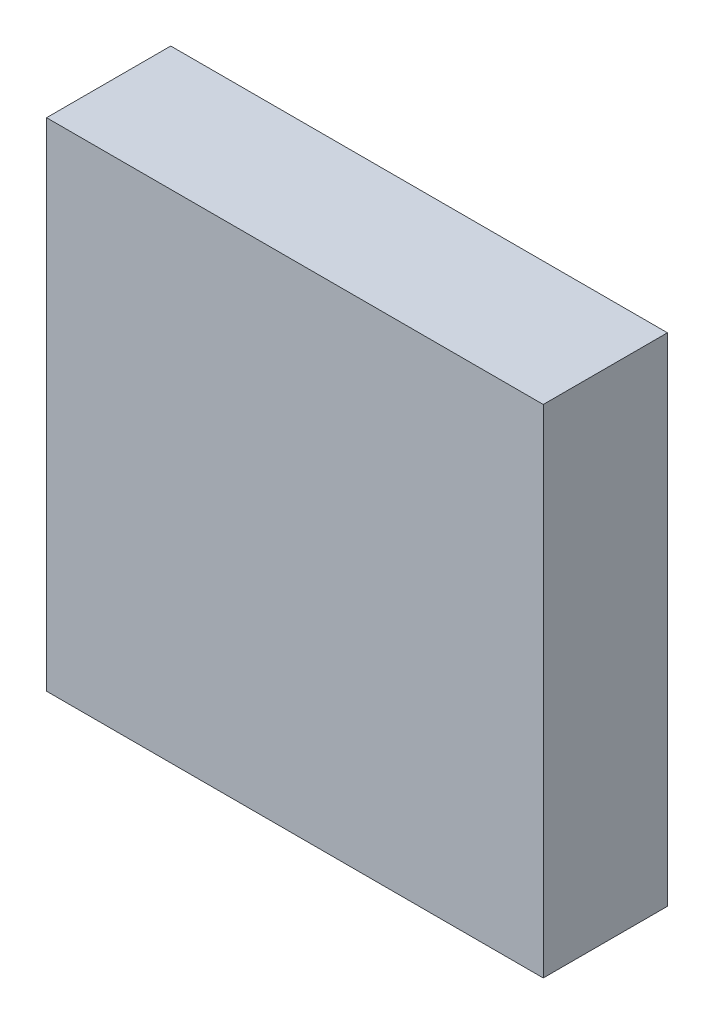
ISO-10303-21;
HEADER;
FILE_DESCRIPTION(('STEP AP214'),'2;1');
FILE_NAME('part.step','',(''),(''),'','','');
FILE_SCHEMA(('AUTOMOTIVE_DESIGN { 1 0 10303 214 1 1 1 1 }'));
ENDSEC;
DATA;
#1=APPLICATION_CONTEXT('core data for automotive mechanical design processes');
#2=APPLICATION_PROTOCOL_DEFINITION('international standard','automotive_design',2000,#1);
#3=PRODUCT_CONTEXT('',#1,'mechanical');
#4=PRODUCT('Part','Part','',(#3));
#5=PRODUCT_RELATED_PRODUCT_CATEGORY('part','',(#4));
#6=PRODUCT_DEFINITION_FORMATION('','',#4);
#7=PRODUCT_DEFINITION_CONTEXT('part definition',#1,'design');
#8=PRODUCT_DEFINITION('design','',#6,#7);
#9=PRODUCT_DEFINITION_SHAPE('','',#8);
#10=(LENGTH_UNIT() NAMED_UNIT(*) SI_UNIT(.MILLI.,.METRE.));
#11=(NAMED_UNIT(*) PLANE_ANGLE_UNIT() SI_UNIT($,.RADIAN.));
#12=(NAMED_UNIT(*) SI_UNIT($,.STERADIAN.) SOLID_ANGLE_UNIT());
#13=UNCERTAINTY_MEASURE_WITH_UNIT(LENGTH_MEASURE(1.E-05),#10,'distance_accuracy_value','');
#14=(GEOMETRIC_REPRESENTATION_CONTEXT(3) GLOBAL_UNCERTAINTY_ASSIGNED_CONTEXT((#13)) GLOBAL_UNIT_ASSIGNED_CONTEXT((#10,
#11,#12)) REPRESENTATION_CONTEXT('',''));
#15=CARTESIAN_POINT('',(0.,0.,0.));
#16=DIRECTION('',(0.,0.,1.));
#17=DIRECTION('',(1.,0.,0.));
#18=AXIS2_PLACEMENT_3D('',#15,#16,#17);
#19=CARTESIAN_POINT('',(1.49999954,-1.49999954,0.75000104));
#20=DIRECTION('',(0.,0.,1.));
#21=DIRECTION('',(1.,0.,0.));
#22=AXIS2_PLACEMENT_3D('',#19,#20,#21);
#23=PLANE('',#22);
#24=DIRECTION('',(0.,1.,0.));
#25=VECTOR('',#24,1.);
#26=CARTESIAN_POINT('',(-1.49999954,-1.49999954,0.75000104));
#27=LINE('',#26,#25);
#28=CARTESIAN_POINT('',(-1.49999954,-1.49999954,0.75000104));
#29=VERTEX_POINT('',#28);
#30=CARTESIAN_POINT('',(-1.49999954,1.49999954,0.75000104));
#31=VERTEX_POINT('',#30);
#32=EDGE_CURVE('E53',#29,#31,#27,.T.);
#33=ORIENTED_EDGE('',*,*,#32,.F.);
#34=DIRECTION('',(1.,0.,0.));
#35=VECTOR('',#34,1.);
#36=CARTESIAN_POINT('',(1.49999954,-1.49999954,0.75000104));
#37=LINE('',#36,#35);
#38=CARTESIAN_POINT('',(1.49999954,-1.49999954,0.75000104));
#39=VERTEX_POINT('',#38);
#40=EDGE_CURVE('E68',#39,#29,#37,.F.);
#41=ORIENTED_EDGE('',*,*,#40,.F.);
#42=DIRECTION('',(0.,1.,0.));
#43=VECTOR('',#42,1.);
#44=CARTESIAN_POINT('',(1.49999954,1.49999954,0.75000104));
#45=LINE('',#44,#43);
#46=CARTESIAN_POINT('',(1.49999954,1.49999954,0.75000104));
#47=VERTEX_POINT('',#46);
#48=EDGE_CURVE('E20',#47,#39,#45,.F.);
#49=ORIENTED_EDGE('',*,*,#48,.F.);
#50=DIRECTION('',(1.,0.,0.));
#51=VECTOR('',#50,1.);
#52=CARTESIAN_POINT('',(-1.49999954,1.49999954,0.75000104));
#53=LINE('',#52,#51);
#54=EDGE_CURVE('E58',#31,#47,#53,.T.);
#55=ORIENTED_EDGE('',*,*,#54,.F.);
#56=EDGE_LOOP('',(#33,#41,#49,#55));
#57=FACE_BOUND('',#56,.T.);
#58=ADVANCED_FACE('F17',(#57),#23,.T.);
#59=CARTESIAN_POINT('',(1.49999954,1.49999954,0.));
#60=DIRECTION('',(1.,0.,0.));
#61=DIRECTION('',(0.,0.,-1.));
#62=AXIS2_PLACEMENT_3D('',#59,#60,#61);
#63=PLANE('',#62);
#64=DIRECTION('',(0.,0.,-1.));
#65=VECTOR('',#64,1.);
#66=CARTESIAN_POINT('',(1.49999954,-1.49999954,0.));
#67=LINE('',#66,#65);
#68=CARTESIAN_POINT('',(1.49999954,-1.49999954,0.));
#69=VERTEX_POINT('',#68);
#70=EDGE_CURVE('E79',#69,#39,#67,.F.);
#71=ORIENTED_EDGE('',*,*,#70,.F.);
#72=DIRECTION('',(0.,1.,0.));
#73=VECTOR('',#72,1.);
#74=CARTESIAN_POINT('',(1.49999954,-1.49999954,0.));
#75=LINE('',#74,#73);
#76=CARTESIAN_POINT('',(1.49999954,1.49999954,0.));
#77=VERTEX_POINT('',#76);
#78=EDGE_CURVE('E74',#69,#77,#75,.T.);
#79=ORIENTED_EDGE('',*,*,#78,.T.);
#80=DIRECTION('',(0.,0.,1.));
#81=VECTOR('',#80,1.);
#82=CARTESIAN_POINT('',(1.49999954,1.49999954,0.));
#83=LINE('',#82,#81);
#84=EDGE_CURVE('E63',#47,#77,#83,.F.);
#85=ORIENTED_EDGE('',*,*,#84,.F.);
#86=ORIENTED_EDGE('',*,*,#48,.T.);
#87=EDGE_LOOP('',(#71,#79,#85,#86));
#88=FACE_BOUND('',#87,.T.);
#89=ADVANCED_FACE('F73',(#88),#63,.T.);
#90=CARTESIAN_POINT('',(-1.49999954,1.49999954,0.));
#91=DIRECTION('',(0.,1.,0.));
#92=DIRECTION('',(0.,0.,1.));
#93=AXIS2_PLACEMENT_3D('',#90,#91,#92);
#94=PLANE('',#93);
#95=ORIENTED_EDGE('',*,*,#84,.T.);
#96=DIRECTION('',(1.,0.,0.));
#97=VECTOR('',#96,1.);
#98=CARTESIAN_POINT('',(1.49999954,1.49999954,0.));
#99=LINE('',#98,#97);
#100=CARTESIAN_POINT('',(-1.49999954,1.49999954,0.));
#101=VERTEX_POINT('',#100);
#102=EDGE_CURVE('E84',#77,#101,#99,.F.);
#103=ORIENTED_EDGE('',*,*,#102,.T.);
#104=DIRECTION('',(0.,0.,1.));
#105=VECTOR('',#104,1.);
#106=CARTESIAN_POINT('',(-1.49999954,1.49999954,0.));
#107=LINE('',#106,#105);
#108=EDGE_CURVE('E65',#31,#101,#107,.F.);
#109=ORIENTED_EDGE('',*,*,#108,.F.);
#110=ORIENTED_EDGE('',*,*,#54,.T.);
#111=EDGE_LOOP('',(#95,#103,#109,#110));
#112=FACE_BOUND('',#111,.T.);
#113=ADVANCED_FACE('F60',(#112),#94,.T.);
#114=CARTESIAN_POINT('',(-1.49999954,-1.49999954,0.));
#115=DIRECTION('',(-1.,0.,0.));
#116=DIRECTION('',(0.,0.,1.));
#117=AXIS2_PLACEMENT_3D('',#114,#115,#116);
#118=PLANE('',#117);
#119=ORIENTED_EDGE('',*,*,#108,.T.);
#120=DIRECTION('',(0.,1.,0.));
#121=VECTOR('',#120,1.);
#122=CARTESIAN_POINT('',(-1.49999954,-1.49999954,0.));
#123=LINE('',#122,#121);
#124=CARTESIAN_POINT('',(-1.49999954,-1.49999954,0.));
#125=VERTEX_POINT('',#124);
#126=EDGE_CURVE('E26',#101,#125,#123,.F.);
#127=ORIENTED_EDGE('',*,*,#126,.T.);
#128=DIRECTION('',(0.,0.,-1.));
#129=VECTOR('',#128,1.);
#130=CARTESIAN_POINT('',(-1.49999954,-1.49999954,0.));
#131=LINE('',#130,#129);
#132=EDGE_CURVE('E34',#29,#125,#131,.T.);
#133=ORIENTED_EDGE('',*,*,#132,.F.);
#134=ORIENTED_EDGE('',*,*,#32,.T.);
#135=EDGE_LOOP('',(#119,#127,#133,#134));
#136=FACE_BOUND('',#135,.T.);
#137=ADVANCED_FACE('F88',(#136),#118,.T.);
#138=CARTESIAN_POINT('',(1.49999954,-1.49999954,0.));
#139=DIRECTION('',(0.,-1.,0.));
#140=DIRECTION('',(0.,0.,-1.));
#141=AXIS2_PLACEMENT_3D('',#138,#139,#140);
#142=PLANE('',#141);
#143=ORIENTED_EDGE('',*,*,#132,.T.);
#144=DIRECTION('',(1.,0.,0.));
#145=VECTOR('',#144,1.);
#146=CARTESIAN_POINT('',(1.49999954,-1.49999954,0.));
#147=LINE('',#146,#145);
#148=EDGE_CURVE('E11',#125,#69,#147,.T.);
#149=ORIENTED_EDGE('',*,*,#148,.T.);
#150=ORIENTED_EDGE('',*,*,#70,.T.);
#151=ORIENTED_EDGE('',*,*,#40,.T.);
#152=EDGE_LOOP('',(#143,#149,#150,#151));
#153=FACE_BOUND('',#152,.T.);
#154=ADVANCED_FACE('F91',(#153),#142,.T.);
#155=CARTESIAN_POINT('',(1.49999954,-1.49999954,0.));
#156=DIRECTION('',(0.,0.,1.));
#157=DIRECTION('',(1.,0.,0.));
#158=AXIS2_PLACEMENT_3D('',#155,#156,#157);
#159=PLANE('',#158);
#160=ORIENTED_EDGE('',*,*,#126,.F.);
#161=ORIENTED_EDGE('',*,*,#102,.F.);
#162=ORIENTED_EDGE('',*,*,#78,.F.);
#163=ORIENTED_EDGE('',*,*,#148,.F.);
#164=EDGE_LOOP('',(#160,#161,#162,#163));
#165=FACE_BOUND('',#164,.T.);
#166=ADVANCED_FACE('F90',(#165),#159,.F.);
#167=CLOSED_SHELL('',(#58,#89,#113,#137,#154,#166));
#168=MANIFOLD_SOLID_BREP('B1',#167);
#169=ADVANCED_BREP_SHAPE_REPRESENTATION('',(#18,#168),#14);
#170=SHAPE_DEFINITION_REPRESENTATION(#9,#169);
ENDSEC;
END-ISO-10303-21;
